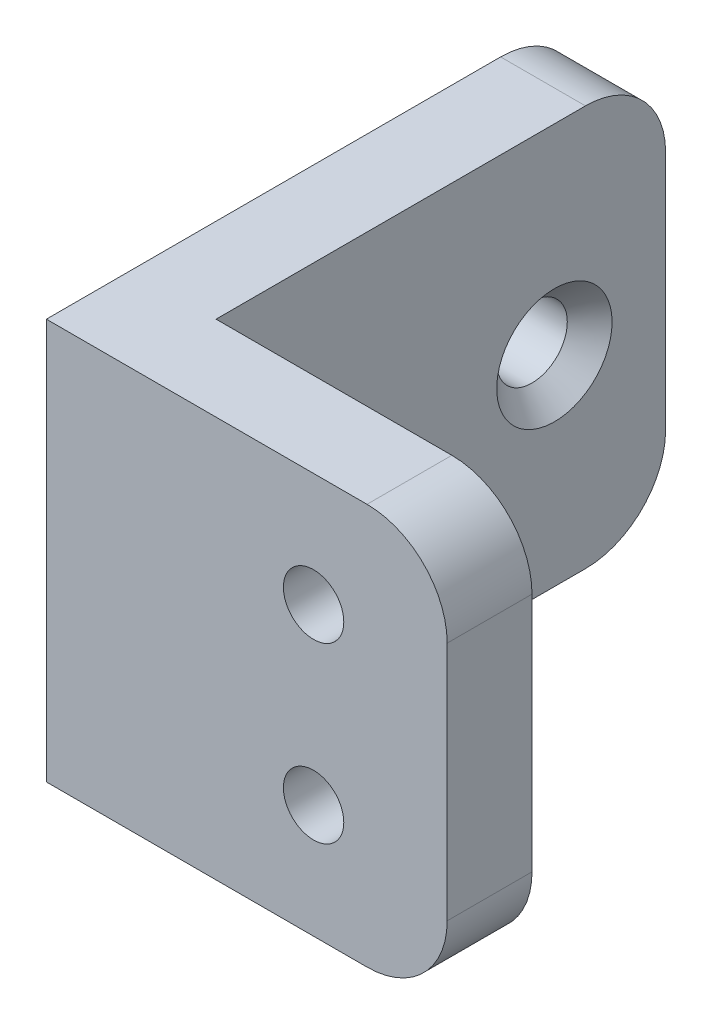
ISO-10303-21;
HEADER;
FILE_DESCRIPTION(('STEP AP214'),'2;1');
FILE_NAME('part.step','',(''),(''),'','','');
FILE_SCHEMA(('AUTOMOTIVE_DESIGN { 1 0 10303 214 1 1 1 1 }'));
ENDSEC;
DATA;
#1=APPLICATION_CONTEXT('core data for automotive mechanical design processes');
#2=APPLICATION_PROTOCOL_DEFINITION('international standard','automotive_design',2000,#1);
#3=PRODUCT_CONTEXT('',#1,'mechanical');
#4=PRODUCT('Part','Part','',(#3));
#5=PRODUCT_RELATED_PRODUCT_CATEGORY('part','',(#4));
#6=PRODUCT_DEFINITION_FORMATION('','',#4);
#7=PRODUCT_DEFINITION_CONTEXT('part definition',#1,'design');
#8=PRODUCT_DEFINITION('design','',#6,#7);
#9=PRODUCT_DEFINITION_SHAPE('','',#8);
#10=(LENGTH_UNIT() NAMED_UNIT(*) SI_UNIT(.MILLI.,.METRE.));
#11=(NAMED_UNIT(*) PLANE_ANGLE_UNIT() SI_UNIT($,.RADIAN.));
#12=(NAMED_UNIT(*) SI_UNIT($,.STERADIAN.) SOLID_ANGLE_UNIT());
#13=UNCERTAINTY_MEASURE_WITH_UNIT(LENGTH_MEASURE(1.E-05),#10,'distance_accuracy_value','');
#14=(GEOMETRIC_REPRESENTATION_CONTEXT(3) GLOBAL_UNCERTAINTY_ASSIGNED_CONTEXT((#13)) GLOBAL_UNIT_ASSIGNED_CONTEXT((#10,
#11,#12)) REPRESENTATION_CONTEXT('',''));
#15=CARTESIAN_POINT('',(0.,0.,0.));
#16=DIRECTION('',(0.,0.,1.));
#17=DIRECTION('',(1.,0.,0.));
#18=AXIS2_PLACEMENT_3D('',#15,#16,#17);
#19=CARTESIAN_POINT('',(15.,7.5,0.));
#20=DIRECTION('',(0.,0.,-1.));
#21=DIRECTION('',(-1.,0.,0.));
#22=AXIS2_PLACEMENT_3D('',#19,#20,#21);
#23=PLANE('',#22);
#24=CARTESIAN_POINT('',(10.,-3.25,0.));
#25=DIRECTION('',(0.,0.,1.));
#26=DIRECTION('',(1.,0.,0.));
#27=AXIS2_PLACEMENT_3D('',#24,#25,#26);
#28=CIRCLE('',#27,1.13029999999999);
#29=CARTESIAN_POINT('',(11.1303,-3.25,0.));
#30=VERTEX_POINT('',#29);
#31=EDGE_CURVE('E337',#30,#30,#28,.T.);
#32=ORIENTED_EDGE('',*,*,#31,.F.);
#33=EDGE_LOOP('',(#32));
#34=FACE_BOUND('',#33,.T.);
#35=CARTESIAN_POINT('',(10.,3.25,0.));
#36=DIRECTION('',(0.,0.,1.));
#37=DIRECTION('',(1.,0.,0.));
#38=AXIS2_PLACEMENT_3D('',#35,#36,#37);
#39=CIRCLE('',#38,1.13029999999999);
#40=CARTESIAN_POINT('',(11.1303,3.25,0.));
#41=VERTEX_POINT('',#40);
#42=EDGE_CURVE('E345',#41,#41,#39,.T.);
#43=ORIENTED_EDGE('',*,*,#42,.F.);
#44=EDGE_LOOP('',(#43));
#45=FACE_BOUND('',#44,.T.);
#46=DIRECTION('',(1.,0.,0.));
#47=VECTOR('',#46,1.);
#48=CARTESIAN_POINT('',(15.,-7.5,0.));
#49=LINE('',#48,#47);
#50=CARTESIAN_POINT('',(0.,-7.5,0.));
#51=VERTEX_POINT('',#50);
#52=CARTESIAN_POINT('',(12.,-7.5,0.));
#53=VERTEX_POINT('',#52);
#54=EDGE_CURVE('E156',#51,#53,#49,.T.);
#55=ORIENTED_EDGE('',*,*,#54,.T.);
#56=CARTESIAN_POINT('',(12.,-4.5,0.));
#57=DIRECTION('',(0.,0.,-1.));
#58=DIRECTION('',(-1.,0.,0.));
#59=AXIS2_PLACEMENT_3D('',#56,#57,#58);
#60=CIRCLE('',#59,3.);
#61=CARTESIAN_POINT('',(15.,-4.5,0.));
#62=VERTEX_POINT('',#61);
#63=EDGE_CURVE('E11',#53,#62,#60,.F.);
#64=ORIENTED_EDGE('',*,*,#63,.T.);
#65=DIRECTION('',(0.,-1.,0.));
#66=VECTOR('',#65,1.);
#67=CARTESIAN_POINT('',(15.,7.5,0.));
#68=LINE('',#67,#66);
#69=CARTESIAN_POINT('',(15.,4.5,0.));
#70=VERTEX_POINT('',#69);
#71=EDGE_CURVE('E180',#70,#62,#68,.T.);
#72=ORIENTED_EDGE('',*,*,#71,.F.);
#73=CARTESIAN_POINT('',(12.,4.5,0.));
#74=DIRECTION('',(0.,0.,-1.));
#75=DIRECTION('',(-1.,0.,0.));
#76=AXIS2_PLACEMENT_3D('',#73,#74,#75);
#77=CIRCLE('',#76,3.);
#78=CARTESIAN_POINT('',(12.,7.5,0.));
#79=VERTEX_POINT('',#78);
#80=EDGE_CURVE('E47',#70,#79,#77,.F.);
#81=ORIENTED_EDGE('',*,*,#80,.T.);
#82=DIRECTION('',(1.,0.,0.));
#83=VECTOR('',#82,1.);
#84=CARTESIAN_POINT('',(15.,7.5,0.));
#85=LINE('',#84,#83);
#86=CARTESIAN_POINT('',(0.,7.5,0.));
#87=VERTEX_POINT('',#86);
#88=EDGE_CURVE('E129',#87,#79,#85,.T.);
#89=ORIENTED_EDGE('',*,*,#88,.F.);
#90=DIRECTION('',(0.,-1.,0.));
#91=VECTOR('',#90,1.);
#92=CARTESIAN_POINT('',(0.,7.5,0.));
#93=LINE('',#92,#91);
#94=EDGE_CURVE('E152',#87,#51,#93,.T.);
#95=ORIENTED_EDGE('',*,*,#94,.T.);
#96=EDGE_LOOP('',(#55,#64,#72,#81,#89,#95));
#97=FACE_BOUND('',#96,.T.);
#98=ADVANCED_FACE('F38',(#34,#45,#97),#23,.F.);
#99=CARTESIAN_POINT('',(15.,7.5,-3.175));
#100=DIRECTION('',(-1.,0.,0.));
#101=DIRECTION('',(0.,0.,1.));
#102=AXIS2_PLACEMENT_3D('',#99,#100,#101);
#103=PLANE('',#102);
#104=ORIENTED_EDGE('',*,*,#71,.T.);
#105=DIRECTION('',(0.,0.,-1.));
#106=VECTOR('',#105,1.);
#107=CARTESIAN_POINT('',(15.,-4.5,-3.175));
#108=LINE('',#107,#106);
#109=CARTESIAN_POINT('',(15.,-4.5,-3.175));
#110=VERTEX_POINT('',#109);
#111=EDGE_CURVE('E214',#62,#110,#108,.T.);
#112=ORIENTED_EDGE('',*,*,#111,.T.);
#113=DIRECTION('',(0.,-1.,0.));
#114=VECTOR('',#113,1.);
#115=CARTESIAN_POINT('',(15.,7.5,-3.175));
#116=LINE('',#115,#114);
#117=CARTESIAN_POINT('',(15.,4.5,-3.175));
#118=VERTEX_POINT('',#117);
#119=EDGE_CURVE('E141',#118,#110,#116,.T.);
#120=ORIENTED_EDGE('',*,*,#119,.F.);
#121=DIRECTION('',(0.,0.,-1.));
#122=VECTOR('',#121,1.);
#123=CARTESIAN_POINT('',(15.,4.5,-3.175));
#124=LINE('',#123,#122);
#125=EDGE_CURVE('E59',#118,#70,#124,.F.);
#126=ORIENTED_EDGE('',*,*,#125,.T.);
#127=EDGE_LOOP('',(#104,#112,#120,#126));
#128=FACE_BOUND('',#127,.T.);
#129=ADVANCED_FACE('F230',(#128),#103,.F.);
#130=CARTESIAN_POINT('',(3.175,7.5,-3.175));
#131=DIRECTION('',(0.,0.,1.));
#132=DIRECTION('',(1.,0.,0.));
#133=AXIS2_PLACEMENT_3D('',#130,#131,#132);
#134=PLANE('',#133);
#135=CARTESIAN_POINT('',(10.,-3.25,-3.175));
#136=DIRECTION('',(0.,0.,1.));
#137=DIRECTION('',(1.,0.,0.));
#138=AXIS2_PLACEMENT_3D('',#135,#136,#137);
#139=CIRCLE('',#138,1.13029999999999);
#140=CARTESIAN_POINT('',(11.1303,-3.25,-3.175));
#141=VERTEX_POINT('',#140);
#142=EDGE_CURVE('E341',#141,#141,#139,.T.);
#143=ORIENTED_EDGE('',*,*,#142,.T.);
#144=EDGE_LOOP('',(#143));
#145=FACE_BOUND('',#144,.T.);
#146=CARTESIAN_POINT('',(10.,3.25,-3.175));
#147=DIRECTION('',(0.,0.,1.));
#148=DIRECTION('',(1.,0.,0.));
#149=AXIS2_PLACEMENT_3D('',#146,#147,#148);
#150=CIRCLE('',#149,1.13029999999999);
#151=CARTESIAN_POINT('',(11.1303,3.25,-3.175));
#152=VERTEX_POINT('',#151);
#153=EDGE_CURVE('E159',#152,#152,#150,.T.);
#154=ORIENTED_EDGE('',*,*,#153,.T.);
#155=EDGE_LOOP('',(#154));
#156=FACE_BOUND('',#155,.T.);
#157=ORIENTED_EDGE('',*,*,#119,.T.);
#158=CARTESIAN_POINT('',(12.,-4.5,-3.175));
#159=DIRECTION('',(0.,0.,1.));
#160=DIRECTION('',(1.,0.,0.));
#161=AXIS2_PLACEMENT_3D('',#158,#159,#160);
#162=CIRCLE('',#161,3.);
#163=CARTESIAN_POINT('',(12.,-7.5,-3.175));
#164=VERTEX_POINT('',#163);
#165=EDGE_CURVE('E221',#110,#164,#162,.F.);
#166=ORIENTED_EDGE('',*,*,#165,.T.);
#167=DIRECTION('',(-1.,0.,0.));
#168=VECTOR('',#167,1.);
#169=CARTESIAN_POINT('',(3.175,-7.5,-3.175));
#170=LINE('',#169,#168);
#171=CARTESIAN_POINT('',(3.175,-7.5,-3.175));
#172=VERTEX_POINT('',#171);
#173=EDGE_CURVE('E136',#164,#172,#170,.T.);
#174=ORIENTED_EDGE('',*,*,#173,.T.);
#175=DIRECTION('',(0.,-1.,0.));
#176=VECTOR('',#175,1.);
#177=CARTESIAN_POINT('',(3.175,7.5,-3.175));
#178=LINE('',#177,#176);
#179=CARTESIAN_POINT('',(3.175,7.5,-3.175));
#180=VERTEX_POINT('',#179);
#181=EDGE_CURVE('E132',#180,#172,#178,.T.);
#182=ORIENTED_EDGE('',*,*,#181,.F.);
#183=DIRECTION('',(-1.,0.,0.));
#184=VECTOR('',#183,1.);
#185=CARTESIAN_POINT('',(3.175,7.5,-3.175));
#186=LINE('',#185,#184);
#187=CARTESIAN_POINT('',(12.,7.5,-3.175));
#188=VERTEX_POINT('',#187);
#189=EDGE_CURVE('E117',#188,#180,#186,.T.);
#190=ORIENTED_EDGE('',*,*,#189,.F.);
#191=CARTESIAN_POINT('',(12.,4.5,-3.175));
#192=DIRECTION('',(0.,0.,1.));
#193=DIRECTION('',(1.,0.,0.));
#194=AXIS2_PLACEMENT_3D('',#191,#192,#193);
#195=CIRCLE('',#194,3.);
#196=EDGE_CURVE('E218',#188,#118,#195,.F.);
#197=ORIENTED_EDGE('',*,*,#196,.T.);
#198=EDGE_LOOP('',(#157,#166,#174,#182,#190,#197));
#199=FACE_BOUND('',#198,.T.);
#200=ADVANCED_FACE('F134',(#145,#156,#199),#134,.F.);
#201=CARTESIAN_POINT('',(3.175,7.5,-20.));
#202=DIRECTION('',(-1.,0.,0.));
#203=DIRECTION('',(0.,0.,1.));
#204=AXIS2_PLACEMENT_3D('',#201,#202,#203);
#205=PLANE('',#204);
#206=CARTESIAN_POINT('',(3.175,0.,-7.3375));
#207=DIRECTION('',(1.,0.,0.));
#208=DIRECTION('',(0.,0.,-1.));
#209=AXIS2_PLACEMENT_3D('',#206,#207,#208);
#210=CIRCLE('',#209,2.159);
#211=CARTESIAN_POINT('',(3.175,0.,-9.4965));
#212=VERTEX_POINT('',#211);
#213=EDGE_CURVE('E315',#212,#212,#210,.T.);
#214=ORIENTED_EDGE('',*,*,#213,.F.);
#215=EDGE_LOOP('',(#214));
#216=FACE_BOUND('',#215,.T.);
#217=CARTESIAN_POINT('',(3.175,0.,-15.8375));
#218=DIRECTION('',(1.,0.,0.));
#219=DIRECTION('',(0.,0.,-1.));
#220=AXIS2_PLACEMENT_3D('',#217,#218,#219);
#221=CIRCLE('',#220,2.159);
#222=CARTESIAN_POINT('',(3.175,0.,-17.9965));
#223=VERTEX_POINT('',#222);
#224=EDGE_CURVE('E325',#223,#223,#221,.T.);
#225=ORIENTED_EDGE('',*,*,#224,.F.);
#226=EDGE_LOOP('',(#225));
#227=FACE_BOUND('',#226,.T.);
#228=DIRECTION('',(0.,0.,-1.));
#229=VECTOR('',#228,1.);
#230=CARTESIAN_POINT('',(3.175,-7.5,-20.));
#231=LINE('',#230,#229);
#232=CARTESIAN_POINT('',(3.175,-7.5,-17.));
#233=VERTEX_POINT('',#232);
#234=EDGE_CURVE('E162',#172,#233,#231,.T.);
#235=ORIENTED_EDGE('',*,*,#234,.T.);
#236=CARTESIAN_POINT('',(3.175,-4.5,-17.));
#237=DIRECTION('',(-1.,0.,0.));
#238=DIRECTION('',(0.,0.,1.));
#239=AXIS2_PLACEMENT_3D('',#236,#237,#238);
#240=CIRCLE('',#239,3.);
#241=CARTESIAN_POINT('',(3.175,-4.5,-20.));
#242=VERTEX_POINT('',#241);
#243=EDGE_CURVE('E204',#233,#242,#240,.F.);
#244=ORIENTED_EDGE('',*,*,#243,.T.);
#245=DIRECTION('',(0.,-1.,0.));
#246=VECTOR('',#245,1.);
#247=CARTESIAN_POINT('',(3.175,7.5,-20.));
#248=LINE('',#247,#246);
#249=CARTESIAN_POINT('',(3.175,4.5,-20.));
#250=VERTEX_POINT('',#249);
#251=EDGE_CURVE('E142',#250,#242,#248,.T.);
#252=ORIENTED_EDGE('',*,*,#251,.F.);
#253=CARTESIAN_POINT('',(3.175,4.5,-17.));
#254=DIRECTION('',(-1.,0.,0.));
#255=DIRECTION('',(0.,0.,1.));
#256=AXIS2_PLACEMENT_3D('',#253,#254,#255);
#257=CIRCLE('',#256,3.);
#258=CARTESIAN_POINT('',(3.175,7.5,-17.));
#259=VERTEX_POINT('',#258);
#260=EDGE_CURVE('E147',#250,#259,#257,.F.);
#261=ORIENTED_EDGE('',*,*,#260,.T.);
#262=DIRECTION('',(0.,0.,-1.));
#263=VECTOR('',#262,1.);
#264=CARTESIAN_POINT('',(3.175,7.5,-20.));
#265=LINE('',#264,#263);
#266=EDGE_CURVE('E122',#180,#259,#265,.T.);
#267=ORIENTED_EDGE('',*,*,#266,.F.);
#268=ORIENTED_EDGE('',*,*,#181,.T.);
#269=EDGE_LOOP('',(#235,#244,#252,#261,#267,#268));
#270=FACE_BOUND('',#269,.T.);
#271=ADVANCED_FACE('F144',(#216,#227,#270),#205,.F.);
#272=CARTESIAN_POINT('',(0.,7.5,-20.));
#273=DIRECTION('',(0.,0.,1.));
#274=DIRECTION('',(1.,0.,0.));
#275=AXIS2_PLACEMENT_3D('',#272,#273,#274);
#276=PLANE('',#275);
#277=ORIENTED_EDGE('',*,*,#251,.T.);
#278=DIRECTION('',(-1.,0.,0.));
#279=VECTOR('',#278,1.);
#280=CARTESIAN_POINT('',(0.,-4.5,-20.));
#281=LINE('',#280,#279);
#282=CARTESIAN_POINT('',(0.,-4.5,-20.));
#283=VERTEX_POINT('',#282);
#284=EDGE_CURVE('E186',#242,#283,#281,.T.);
#285=ORIENTED_EDGE('',*,*,#284,.T.);
#286=DIRECTION('',(0.,-1.,0.));
#287=VECTOR('',#286,1.);
#288=CARTESIAN_POINT('',(0.,7.5,-20.));
#289=LINE('',#288,#287);
#290=CARTESIAN_POINT('',(0.,4.5,-20.));
#291=VERTEX_POINT('',#290);
#292=EDGE_CURVE('E171',#291,#283,#289,.T.);
#293=ORIENTED_EDGE('',*,*,#292,.F.);
#294=DIRECTION('',(-1.,0.,0.));
#295=VECTOR('',#294,1.);
#296=CARTESIAN_POINT('',(0.,4.5,-20.));
#297=LINE('',#296,#295);
#298=EDGE_CURVE('E183',#291,#250,#297,.F.);
#299=ORIENTED_EDGE('',*,*,#298,.T.);
#300=EDGE_LOOP('',(#277,#285,#293,#299));
#301=FACE_BOUND('',#300,.T.);
#302=ADVANCED_FACE('F246',(#301),#276,.F.);
#303=CARTESIAN_POINT('',(0.,7.5,0.));
#304=DIRECTION('',(1.,0.,0.));
#305=DIRECTION('',(0.,0.,-1.));
#306=AXIS2_PLACEMENT_3D('',#303,#304,#305);
#307=PLANE('',#306);
#308=CARTESIAN_POINT('',(0.,0.,-7.3375));
#309=DIRECTION('',(1.,0.,0.));
#310=DIRECTION('',(0.,0.,-1.));
#311=AXIS2_PLACEMENT_3D('',#308,#309,#310);
#312=CIRCLE('',#311,1.32079999999999);
#313=CARTESIAN_POINT('',(0.,0.,-8.65829999999999));
#314=VERTEX_POINT('',#313);
#315=EDGE_CURVE('E319',#314,#314,#312,.T.);
#316=ORIENTED_EDGE('',*,*,#315,.T.);
#317=EDGE_LOOP('',(#316));
#318=FACE_BOUND('',#317,.T.);
#319=CARTESIAN_POINT('',(0.,0.,-15.8375));
#320=DIRECTION('',(1.,0.,0.));
#321=DIRECTION('',(0.,0.,-1.));
#322=AXIS2_PLACEMENT_3D('',#319,#320,#321);
#323=CIRCLE('',#322,1.32079999999999);
#324=CARTESIAN_POINT('',(0.,0.,-17.1583));
#325=VERTEX_POINT('',#324);
#326=EDGE_CURVE('E333',#325,#325,#323,.T.);
#327=ORIENTED_EDGE('',*,*,#326,.T.);
#328=EDGE_LOOP('',(#327));
#329=FACE_BOUND('',#328,.T.);
#330=ORIENTED_EDGE('',*,*,#292,.T.);
#331=CARTESIAN_POINT('',(0.,-4.5,-17.));
#332=DIRECTION('',(1.,0.,0.));
#333=DIRECTION('',(0.,0.,-1.));
#334=AXIS2_PLACEMENT_3D('',#331,#332,#333);
#335=CIRCLE('',#334,3.);
#336=CARTESIAN_POINT('',(0.,-7.5,-17.));
#337=VERTEX_POINT('',#336);
#338=EDGE_CURVE('E193',#283,#337,#335,.F.);
#339=ORIENTED_EDGE('',*,*,#338,.T.);
#340=DIRECTION('',(0.,0.,1.));
#341=VECTOR('',#340,1.);
#342=CARTESIAN_POINT('',(0.,-7.5,0.));
#343=LINE('',#342,#341);
#344=EDGE_CURVE('E165',#337,#51,#343,.T.);
#345=ORIENTED_EDGE('',*,*,#344,.T.);
#346=ORIENTED_EDGE('',*,*,#94,.F.);
#347=DIRECTION('',(0.,0.,1.));
#348=VECTOR('',#347,1.);
#349=CARTESIAN_POINT('',(0.,7.5,0.));
#350=LINE('',#349,#348);
#351=CARTESIAN_POINT('',(0.,7.5,-17.));
#352=VERTEX_POINT('',#351);
#353=EDGE_CURVE('E149',#352,#87,#350,.T.);
#354=ORIENTED_EDGE('',*,*,#353,.F.);
#355=CARTESIAN_POINT('',(0.,4.5,-17.));
#356=DIRECTION('',(1.,0.,0.));
#357=DIRECTION('',(0.,0.,-1.));
#358=AXIS2_PLACEMENT_3D('',#355,#356,#357);
#359=CIRCLE('',#358,3.);
#360=EDGE_CURVE('E190',#352,#291,#359,.F.);
#361=ORIENTED_EDGE('',*,*,#360,.T.);
#362=EDGE_LOOP('',(#330,#339,#345,#346,#354,#361));
#363=FACE_BOUND('',#362,.T.);
#364=ADVANCED_FACE('F249',(#318,#329,#363),#307,.F.);
#365=CARTESIAN_POINT('',(0.,7.5,0.));
#366=DIRECTION('',(0.,-1.,0.));
#367=DIRECTION('',(0.,0.,-1.));
#368=AXIS2_PLACEMENT_3D('',#365,#366,#367);
#369=PLANE('',#368);
#370=ORIENTED_EDGE('',*,*,#266,.T.);
#371=DIRECTION('',(-1.,0.,0.));
#372=VECTOR('',#371,1.);
#373=CARTESIAN_POINT('',(0.,7.5,-17.));
#374=LINE('',#373,#372);
#375=EDGE_CURVE('E209',#259,#352,#374,.T.);
#376=ORIENTED_EDGE('',*,*,#375,.T.);
#377=ORIENTED_EDGE('',*,*,#353,.T.);
#378=ORIENTED_EDGE('',*,*,#88,.T.);
#379=DIRECTION('',(0.,0.,-1.));
#380=VECTOR('',#379,1.);
#381=CARTESIAN_POINT('',(12.,7.5,0.));
#382=LINE('',#381,#380);
#383=EDGE_CURVE('E126',#79,#188,#382,.T.);
#384=ORIENTED_EDGE('',*,*,#383,.T.);
#385=ORIENTED_EDGE('',*,*,#189,.T.);
#386=EDGE_LOOP('',(#370,#376,#377,#378,#384,#385));
#387=FACE_BOUND('',#386,.T.);
#388=ADVANCED_FACE('F119',(#387),#369,.F.);
#389=CARTESIAN_POINT('',(0.,-7.5,0.));
#390=DIRECTION('',(0.,-1.,0.));
#391=DIRECTION('',(0.,0.,-1.));
#392=AXIS2_PLACEMENT_3D('',#389,#390,#391);
#393=PLANE('',#392);
#394=ORIENTED_EDGE('',*,*,#344,.F.);
#395=DIRECTION('',(-1.,0.,0.));
#396=VECTOR('',#395,1.);
#397=CARTESIAN_POINT('',(3.175,-7.5,-17.));
#398=LINE('',#397,#396);
#399=EDGE_CURVE('E199',#337,#233,#398,.F.);
#400=ORIENTED_EDGE('',*,*,#399,.T.);
#401=ORIENTED_EDGE('',*,*,#234,.F.);
#402=ORIENTED_EDGE('',*,*,#173,.F.);
#403=DIRECTION('',(0.,0.,-1.));
#404=VECTOR('',#403,1.);
#405=CARTESIAN_POINT('',(12.,-7.5,0.));
#406=LINE('',#405,#404);
#407=EDGE_CURVE('E196',#164,#53,#406,.F.);
#408=ORIENTED_EDGE('',*,*,#407,.T.);
#409=ORIENTED_EDGE('',*,*,#54,.F.);
#410=EDGE_LOOP('',(#394,#400,#401,#402,#408,#409));
#411=FACE_BOUND('',#410,.T.);
#412=ADVANCED_FACE('F237',(#411),#393,.T.);
#413=CARTESIAN_POINT('',(10.,3.25,0.));
#414=DIRECTION('',(0.,0.,1.));
#415=DIRECTION('',(1.,0.,0.));
#416=AXIS2_PLACEMENT_3D('',#413,#414,#415);
#417=CYLINDRICAL_SURFACE('',#416,1.13029999999999);
#418=ORIENTED_EDGE('',*,*,#42,.T.);
#419=EDGE_LOOP('',(#418));
#420=FACE_BOUND('',#419,.T.);
#421=ORIENTED_EDGE('',*,*,#153,.F.);
#422=EDGE_LOOP('',(#421));
#423=FACE_BOUND('',#422,.T.);
#424=ADVANCED_FACE('F284',(#420,#423),#417,.F.);
#425=CARTESIAN_POINT('',(10.,-3.25,0.));
#426=DIRECTION('',(0.,0.,1.));
#427=DIRECTION('',(1.,0.,0.));
#428=AXIS2_PLACEMENT_3D('',#425,#426,#427);
#429=CYLINDRICAL_SURFACE('',#428,1.13029999999999);
#430=ORIENTED_EDGE('',*,*,#31,.T.);
#431=EDGE_LOOP('',(#430));
#432=FACE_BOUND('',#431,.T.);
#433=ORIENTED_EDGE('',*,*,#142,.F.);
#434=EDGE_LOOP('',(#433));
#435=FACE_BOUND('',#434,.T.);
#436=ADVANCED_FACE('F289',(#432,#435),#429,.F.);
#437=CARTESIAN_POINT('',(3.175,0.,-15.8375));
#438=DIRECTION('',(1.,0.,0.));
#439=DIRECTION('',(0.,0.,-1.));
#440=AXIS2_PLACEMENT_3D('',#437,#438,#439);
#441=CYLINDRICAL_SURFACE('',#440,1.32079999999999);
#442=ORIENTED_EDGE('',*,*,#326,.F.);
#443=EDGE_LOOP('',(#442));
#444=FACE_BOUND('',#443,.T.);
#445=CARTESIAN_POINT('',(2.3368,0.,-15.8375));
#446=DIRECTION('',(1.,0.,0.));
#447=DIRECTION('',(0.,0.,-1.));
#448=AXIS2_PLACEMENT_3D('',#445,#446,#447);
#449=CIRCLE('',#448,1.3208);
#450=CARTESIAN_POINT('',(2.3368,0.,-17.1583));
#451=VERTEX_POINT('',#450);
#452=EDGE_CURVE('E329',#451,#451,#449,.T.);
#453=ORIENTED_EDGE('',*,*,#452,.T.);
#454=EDGE_LOOP('',(#453));
#455=FACE_BOUND('',#454,.T.);
#456=ADVANCED_FACE('F293',(#444,#455),#441,.F.);
#457=CARTESIAN_POINT('',(3.175,0.,-15.8375));
#458=DIRECTION('',(1.,0.,0.));
#459=DIRECTION('',(0.,0.,-1.));
#460=AXIS2_PLACEMENT_3D('',#457,#458,#459);
#461=CONICAL_SURFACE('',#460,2.159,0.785398163397449);
#462=ORIENTED_EDGE('',*,*,#452,.F.);
#463=EDGE_LOOP('',(#462));
#464=FACE_BOUND('',#463,.T.);
#465=ORIENTED_EDGE('',*,*,#224,.T.);
#466=EDGE_LOOP('',(#465));
#467=FACE_BOUND('',#466,.T.);
#468=ADVANCED_FACE('F297',(#464,#467),#461,.F.);
#469=CARTESIAN_POINT('',(3.175,0.,-7.3375));
#470=DIRECTION('',(1.,0.,0.));
#471=DIRECTION('',(0.,0.,-1.));
#472=AXIS2_PLACEMENT_3D('',#469,#470,#471);
#473=CYLINDRICAL_SURFACE('',#472,1.32079999999999);
#474=ORIENTED_EDGE('',*,*,#315,.F.);
#475=EDGE_LOOP('',(#474));
#476=FACE_BOUND('',#475,.T.);
#477=CARTESIAN_POINT('',(2.3368,0.,-7.3375));
#478=DIRECTION('',(1.,0.,0.));
#479=DIRECTION('',(0.,0.,-1.));
#480=AXIS2_PLACEMENT_3D('',#477,#478,#479);
#481=CIRCLE('',#480,1.3208);
#482=CARTESIAN_POINT('',(2.3368,0.,-8.6583));
#483=VERTEX_POINT('',#482);
#484=EDGE_CURVE('E312',#483,#483,#481,.T.);
#485=ORIENTED_EDGE('',*,*,#484,.T.);
#486=EDGE_LOOP('',(#485));
#487=FACE_BOUND('',#486,.T.);
#488=ADVANCED_FACE('F301',(#476,#487),#473,.F.);
#489=CARTESIAN_POINT('',(3.175,0.,-7.3375));
#490=DIRECTION('',(1.,0.,0.));
#491=DIRECTION('',(0.,0.,-1.));
#492=AXIS2_PLACEMENT_3D('',#489,#490,#491);
#493=CONICAL_SURFACE('',#492,2.159,0.785398163397449);
#494=ORIENTED_EDGE('',*,*,#484,.F.);
#495=EDGE_LOOP('',(#494));
#496=FACE_BOUND('',#495,.T.);
#497=ORIENTED_EDGE('',*,*,#213,.T.);
#498=EDGE_LOOP('',(#497));
#499=FACE_BOUND('',#498,.T.);
#500=ADVANCED_FACE('F258',(#496,#499),#493,.F.);
#501=CARTESIAN_POINT('',(0.,-4.5,-17.));
#502=DIRECTION('',(1.,0.,0.));
#503=DIRECTION('',(0.,0.,-1.));
#504=AXIS2_PLACEMENT_3D('',#501,#502,#503);
#505=CYLINDRICAL_SURFACE('',#504,3.);
#506=ORIENTED_EDGE('',*,*,#243,.F.);
#507=ORIENTED_EDGE('',*,*,#399,.F.);
#508=ORIENTED_EDGE('',*,*,#338,.F.);
#509=ORIENTED_EDGE('',*,*,#284,.F.);
#510=EDGE_LOOP('',(#506,#507,#508,#509));
#511=FACE_BOUND('',#510,.T.);
#512=ADVANCED_FACE('F243',(#511),#505,.T.);
#513=CARTESIAN_POINT('',(0.,4.5,-17.));
#514=DIRECTION('',(-1.,0.,0.));
#515=DIRECTION('',(0.,0.,1.));
#516=AXIS2_PLACEMENT_3D('',#513,#514,#515);
#517=CYLINDRICAL_SURFACE('',#516,3.);
#518=ORIENTED_EDGE('',*,*,#260,.F.);
#519=ORIENTED_EDGE('',*,*,#298,.F.);
#520=ORIENTED_EDGE('',*,*,#360,.F.);
#521=ORIENTED_EDGE('',*,*,#375,.F.);
#522=EDGE_LOOP('',(#518,#519,#520,#521));
#523=FACE_BOUND('',#522,.T.);
#524=ADVANCED_FACE('F251',(#523),#517,.T.);
#525=CARTESIAN_POINT('',(12.,-4.5,-3.175));
#526=DIRECTION('',(0.,0.,1.));
#527=DIRECTION('',(1.,0.,0.));
#528=AXIS2_PLACEMENT_3D('',#525,#526,#527);
#529=CYLINDRICAL_SURFACE('',#528,3.);
#530=ORIENTED_EDGE('',*,*,#63,.F.);
#531=ORIENTED_EDGE('',*,*,#407,.F.);
#532=ORIENTED_EDGE('',*,*,#165,.F.);
#533=ORIENTED_EDGE('',*,*,#111,.F.);
#534=EDGE_LOOP('',(#530,#531,#532,#533));
#535=FACE_BOUND('',#534,.T.);
#536=ADVANCED_FACE('F233',(#535),#529,.T.);
#537=CARTESIAN_POINT('',(12.,4.5,0.));
#538=DIRECTION('',(0.,0.,-1.));
#539=DIRECTION('',(-1.,0.,0.));
#540=AXIS2_PLACEMENT_3D('',#537,#538,#539);
#541=CYLINDRICAL_SURFACE('',#540,3.);
#542=ORIENTED_EDGE('',*,*,#80,.F.);
#543=ORIENTED_EDGE('',*,*,#125,.F.);
#544=ORIENTED_EDGE('',*,*,#196,.F.);
#545=ORIENTED_EDGE('',*,*,#383,.F.);
#546=EDGE_LOOP('',(#542,#543,#544,#545));
#547=FACE_BOUND('',#546,.T.);
#548=ADVANCED_FACE('F40',(#547),#541,.T.);
#549=CLOSED_SHELL('',(#98,#129,#200,#271,#302,#364,#388,#412,#424,#436,#456,#468,#488,#500,#512,
#524,#536,#548));
#550=MANIFOLD_SOLID_BREP('B2',#549);
#551=ADVANCED_BREP_SHAPE_REPRESENTATION('',(#18,#550),#14);
#552=SHAPE_DEFINITION_REPRESENTATION(#9,#551);
ENDSEC;
END-ISO-10303-21;
